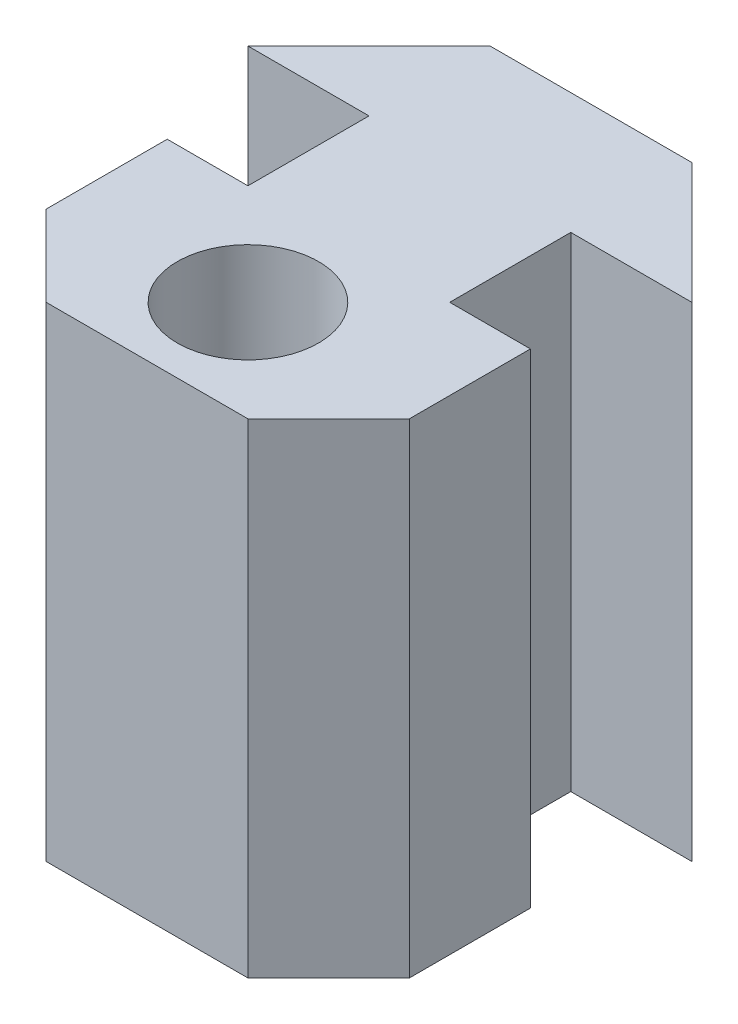
ISO-10303-21;
HEADER;
FILE_DESCRIPTION(('STEP AP214'),'2;1');
FILE_NAME('part.step','',(''),(''),'','','');
FILE_SCHEMA(('AUTOMOTIVE_DESIGN { 1 0 10303 214 1 1 1 1 }'));
ENDSEC;
DATA;
#1=APPLICATION_CONTEXT('core data for automotive mechanical design processes');
#2=APPLICATION_PROTOCOL_DEFINITION('international standard','automotive_design',2000,#1);
#3=PRODUCT_CONTEXT('',#1,'mechanical');
#4=PRODUCT('Part','Part','',(#3));
#5=PRODUCT_RELATED_PRODUCT_CATEGORY('part','',(#4));
#6=PRODUCT_DEFINITION_FORMATION('','',#4);
#7=PRODUCT_DEFINITION_CONTEXT('part definition',#1,'design');
#8=PRODUCT_DEFINITION('design','',#6,#7);
#9=PRODUCT_DEFINITION_SHAPE('','',#8);
#10=(LENGTH_UNIT() NAMED_UNIT(*) SI_UNIT(.MILLI.,.METRE.));
#11=(NAMED_UNIT(*) PLANE_ANGLE_UNIT() SI_UNIT($,.RADIAN.));
#12=(NAMED_UNIT(*) SI_UNIT($,.STERADIAN.) SOLID_ANGLE_UNIT());
#13=UNCERTAINTY_MEASURE_WITH_UNIT(LENGTH_MEASURE(1.E-05),#10,'distance_accuracy_value','');
#14=(GEOMETRIC_REPRESENTATION_CONTEXT(3) GLOBAL_UNCERTAINTY_ASSIGNED_CONTEXT((#13)) GLOBAL_UNIT_ASSIGNED_CONTEXT((#10,
#11,#12)) REPRESENTATION_CONTEXT('',''));
#15=CARTESIAN_POINT('',(0.,0.,0.));
#16=DIRECTION('',(0.,0.,1.));
#17=DIRECTION('',(1.,0.,0.));
#18=AXIS2_PLACEMENT_3D('',#15,#16,#17);
#19=CARTESIAN_POINT('',(0.,12.,0.));
#20=DIRECTION('',(0.,-1.,0.));
#21=DIRECTION('',(0.,0.,-1.));
#22=AXIS2_PLACEMENT_3D('',#19,#20,#21);
#23=PLANE('',#22);
#24=DIRECTION('',(0.,0.,1.));
#25=VECTOR('',#24,1.);
#26=CARTESIAN_POINT('',(-4.5,12.,11.));
#27=LINE('',#26,#25);
#28=CARTESIAN_POINT('',(-4.5,12.,6.));
#29=VERTEX_POINT('',#28);
#30=CARTESIAN_POINT('',(-4.5,12.,9.));
#31=VERTEX_POINT('',#30);
#32=EDGE_CURVE('E187',#29,#31,#27,.T.);
#33=ORIENTED_EDGE('',*,*,#32,.T.);
#34=DIRECTION('',(-0.707106781186547,0.,-0.707106781186548));
#35=VECTOR('',#34,1.);
#36=CARTESIAN_POINT('',(-2.5,12.,11.));
#37=LINE('',#36,#35);
#38=CARTESIAN_POINT('',(-2.5,12.,11.));
#39=VERTEX_POINT('',#38);
#40=EDGE_CURVE('E50',#31,#39,#37,.F.);
#41=ORIENTED_EDGE('',*,*,#40,.T.);
#42=DIRECTION('',(1.,0.,0.));
#43=VECTOR('',#42,1.);
#44=CARTESIAN_POINT('',(4.5,12.,11.));
#45=LINE('',#44,#43);
#46=CARTESIAN_POINT('',(2.5,12.,11.));
#47=VERTEX_POINT('',#46);
#48=EDGE_CURVE('E186',#39,#47,#45,.T.);
#49=ORIENTED_EDGE('',*,*,#48,.T.);
#50=DIRECTION('',(-0.707106781186548,0.,0.707106781186547));
#51=VECTOR('',#50,1.);
#52=CARTESIAN_POINT('',(4.5,12.,9.));
#53=LINE('',#52,#51);
#54=CARTESIAN_POINT('',(4.5,12.,9.));
#55=VERTEX_POINT('',#54);
#56=EDGE_CURVE('E57',#47,#55,#53,.F.);
#57=ORIENTED_EDGE('',*,*,#56,.T.);
#58=DIRECTION('',(0.,0.,-1.));
#59=VECTOR('',#58,1.);
#60=CARTESIAN_POINT('',(4.5,12.,11.));
#61=LINE('',#60,#59);
#62=CARTESIAN_POINT('',(4.5,12.,6.));
#63=VERTEX_POINT('',#62);
#64=EDGE_CURVE('E160',#55,#63,#61,.T.);
#65=ORIENTED_EDGE('',*,*,#64,.T.);
#66=DIRECTION('',(-1.,0.,0.));
#67=VECTOR('',#66,1.);
#68=CARTESIAN_POINT('',(4.5,12.,6.));
#69=LINE('',#68,#67);
#70=CARTESIAN_POINT('',(2.5,12.,6.));
#71=VERTEX_POINT('',#70);
#72=EDGE_CURVE('E156',#63,#71,#69,.T.);
#73=ORIENTED_EDGE('',*,*,#72,.T.);
#74=DIRECTION('',(0.,0.,-1.));
#75=VECTOR('',#74,1.);
#76=CARTESIAN_POINT('',(2.5,12.,6.));
#77=LINE('',#76,#75);
#78=CARTESIAN_POINT('',(2.5,12.,3.));
#79=VERTEX_POINT('',#78);
#80=EDGE_CURVE('E146',#71,#79,#77,.T.);
#81=ORIENTED_EDGE('',*,*,#80,.T.);
#82=DIRECTION('',(1.,0.,0.));
#83=VECTOR('',#82,1.);
#84=CARTESIAN_POINT('',(2.5,12.,3.));
#85=LINE('',#84,#83);
#86=CARTESIAN_POINT('',(5.5,12.,3.));
#87=VERTEX_POINT('',#86);
#88=EDGE_CURVE('E155',#79,#87,#85,.T.);
#89=ORIENTED_EDGE('',*,*,#88,.T.);
#90=DIRECTION('',(-0.707106781186548,0.,-0.707106781186547));
#91=VECTOR('',#90,1.);
#92=CARTESIAN_POINT('',(5.5,12.,3.));
#93=LINE('',#92,#91);
#94=CARTESIAN_POINT('',(2.5,12.,0.));
#95=VERTEX_POINT('',#94);
#96=EDGE_CURVE('E241',#87,#95,#93,.T.);
#97=ORIENTED_EDGE('',*,*,#96,.T.);
#98=DIRECTION('',(-1.,0.,0.));
#99=VECTOR('',#98,1.);
#100=CARTESIAN_POINT('',(2.5,12.,0.));
#101=LINE('',#100,#99);
#102=CARTESIAN_POINT('',(-2.5,12.,0.));
#103=VERTEX_POINT('',#102);
#104=EDGE_CURVE('E279',#95,#103,#101,.T.);
#105=ORIENTED_EDGE('',*,*,#104,.T.);
#106=DIRECTION('',(-0.707106781186548,0.,0.707106781186547));
#107=VECTOR('',#106,1.);
#108=CARTESIAN_POINT('',(-5.5,12.,3.));
#109=LINE('',#108,#107);
#110=CARTESIAN_POINT('',(-5.5,12.,3.));
#111=VERTEX_POINT('',#110);
#112=EDGE_CURVE('E283',#103,#111,#109,.T.);
#113=ORIENTED_EDGE('',*,*,#112,.T.);
#114=DIRECTION('',(1.,0.,0.));
#115=VECTOR('',#114,1.);
#116=CARTESIAN_POINT('',(-2.5,12.,3.));
#117=LINE('',#116,#115);
#118=CARTESIAN_POINT('',(-2.5,12.,3.));
#119=VERTEX_POINT('',#118);
#120=EDGE_CURVE('E271',#111,#119,#117,.T.);
#121=ORIENTED_EDGE('',*,*,#120,.T.);
#122=DIRECTION('',(0.,0.,1.));
#123=VECTOR('',#122,1.);
#124=CARTESIAN_POINT('',(-2.5,12.,6.));
#125=LINE('',#124,#123);
#126=CARTESIAN_POINT('',(-2.5,12.,6.));
#127=VERTEX_POINT('',#126);
#128=EDGE_CURVE('E268',#119,#127,#125,.T.);
#129=ORIENTED_EDGE('',*,*,#128,.T.);
#130=DIRECTION('',(-1.,0.,0.));
#131=VECTOR('',#130,1.);
#132=CARTESIAN_POINT('',(-2.5,12.,6.));
#133=LINE('',#132,#131);
#134=EDGE_CURVE('E267',#127,#29,#133,.T.);
#135=ORIENTED_EDGE('',*,*,#134,.T.);
#136=EDGE_LOOP('',(#33,#41,#49,#57,#65,#73,#81,#89,#97,#105,#113,#121,#129,#135));
#137=FACE_BOUND('',#136,.T.);
#138=CARTESIAN_POINT('',(0.,12.,8.5));
#139=DIRECTION('',(0.,1.,0.));
#140=DIRECTION('',(0.,0.,1.));
#141=AXIS2_PLACEMENT_3D('',#138,#139,#140);
#142=CIRCLE('',#141,1.75);
#143=CARTESIAN_POINT('',(0.,12.,10.25));
#144=VERTEX_POINT('',#143);
#145=EDGE_CURVE('E276',#144,#144,#142,.T.);
#146=ORIENTED_EDGE('',*,*,#145,.F.);
#147=EDGE_LOOP('',(#146));
#148=FACE_BOUND('',#147,.T.);
#149=ADVANCED_FACE('F41',(#137,#148),#23,.F.);
#150=CARTESIAN_POINT('',(0.,0.,0.));
#151=DIRECTION('',(0.,-1.,0.));
#152=DIRECTION('',(0.,0.,-1.));
#153=AXIS2_PLACEMENT_3D('',#150,#151,#152);
#154=PLANE('',#153);
#155=DIRECTION('',(1.,0.,0.));
#156=VECTOR('',#155,1.);
#157=CARTESIAN_POINT('',(4.5,0.,11.));
#158=LINE('',#157,#156);
#159=CARTESIAN_POINT('',(-2.5,0.,11.));
#160=VERTEX_POINT('',#159);
#161=CARTESIAN_POINT('',(2.5,0.,11.));
#162=VERTEX_POINT('',#161);
#163=EDGE_CURVE('E203',#160,#162,#158,.T.);
#164=ORIENTED_EDGE('',*,*,#163,.F.);
#165=DIRECTION('',(0.707106781186547,0.,0.707106781186548));
#166=VECTOR('',#165,1.);
#167=CARTESIAN_POINT('',(-6.75000000000001,0.,6.74999999999999));
#168=LINE('',#167,#166);
#169=CARTESIAN_POINT('',(-4.5,0.,9.));
#170=VERTEX_POINT('',#169);
#171=EDGE_CURVE('E181',#160,#170,#168,.F.);
#172=ORIENTED_EDGE('',*,*,#171,.T.);
#173=DIRECTION('',(0.,0.,1.));
#174=VECTOR('',#173,1.);
#175=CARTESIAN_POINT('',(-4.5,0.,11.));
#176=LINE('',#175,#174);
#177=CARTESIAN_POINT('',(-4.5,0.,6.));
#178=VERTEX_POINT('',#177);
#179=EDGE_CURVE('E202',#178,#170,#176,.T.);
#180=ORIENTED_EDGE('',*,*,#179,.F.);
#181=DIRECTION('',(-1.,0.,0.));
#182=VECTOR('',#181,1.);
#183=CARTESIAN_POINT('',(-2.5,0.,6.));
#184=LINE('',#183,#182);
#185=CARTESIAN_POINT('',(-2.5,0.,6.));
#186=VERTEX_POINT('',#185);
#187=EDGE_CURVE('E208',#186,#178,#184,.T.);
#188=ORIENTED_EDGE('',*,*,#187,.F.);
#189=DIRECTION('',(0.,0.,1.));
#190=VECTOR('',#189,1.);
#191=CARTESIAN_POINT('',(-2.5,0.,6.));
#192=LINE('',#191,#190);
#193=CARTESIAN_POINT('',(-2.5,0.,3.));
#194=VERTEX_POINT('',#193);
#195=EDGE_CURVE('E211',#194,#186,#192,.T.);
#196=ORIENTED_EDGE('',*,*,#195,.F.);
#197=DIRECTION('',(1.,0.,0.));
#198=VECTOR('',#197,1.);
#199=CARTESIAN_POINT('',(-2.5,0.,3.));
#200=LINE('',#199,#198);
#201=CARTESIAN_POINT('',(-5.5,0.,3.));
#202=VERTEX_POINT('',#201);
#203=EDGE_CURVE('E256',#202,#194,#200,.T.);
#204=ORIENTED_EDGE('',*,*,#203,.F.);
#205=DIRECTION('',(-0.707106781186548,0.,0.707106781186547));
#206=VECTOR('',#205,1.);
#207=CARTESIAN_POINT('',(-5.5,0.,3.));
#208=LINE('',#207,#206);
#209=CARTESIAN_POINT('',(-2.5,0.,0.));
#210=VERTEX_POINT('',#209);
#211=EDGE_CURVE('E249',#210,#202,#208,.T.);
#212=ORIENTED_EDGE('',*,*,#211,.F.);
#213=DIRECTION('',(-1.,0.,0.));
#214=VECTOR('',#213,1.);
#215=CARTESIAN_POINT('',(2.5,0.,0.));
#216=LINE('',#215,#214);
#217=CARTESIAN_POINT('',(2.5,0.,0.));
#218=VERTEX_POINT('',#217);
#219=EDGE_CURVE('E247',#218,#210,#216,.T.);
#220=ORIENTED_EDGE('',*,*,#219,.F.);
#221=DIRECTION('',(-0.707106781186548,0.,-0.707106781186547));
#222=VECTOR('',#221,1.);
#223=CARTESIAN_POINT('',(5.5,0.,3.));
#224=LINE('',#223,#222);
#225=CARTESIAN_POINT('',(5.5,0.,3.));
#226=VERTEX_POINT('',#225);
#227=EDGE_CURVE('E240',#226,#218,#224,.T.);
#228=ORIENTED_EDGE('',*,*,#227,.F.);
#229=DIRECTION('',(1.,0.,0.));
#230=VECTOR('',#229,1.);
#231=CARTESIAN_POINT('',(2.5,0.,3.));
#232=LINE('',#231,#230);
#233=CARTESIAN_POINT('',(2.5,0.,3.));
#234=VERTEX_POINT('',#233);
#235=EDGE_CURVE('E245',#234,#226,#232,.T.);
#236=ORIENTED_EDGE('',*,*,#235,.F.);
#237=DIRECTION('',(0.,0.,-1.));
#238=VECTOR('',#237,1.);
#239=CARTESIAN_POINT('',(2.5,0.,6.));
#240=LINE('',#239,#238);
#241=CARTESIAN_POINT('',(2.5,0.,6.));
#242=VERTEX_POINT('',#241);
#243=EDGE_CURVE('E251',#242,#234,#240,.T.);
#244=ORIENTED_EDGE('',*,*,#243,.F.);
#245=DIRECTION('',(-1.,0.,0.));
#246=VECTOR('',#245,1.);
#247=CARTESIAN_POINT('',(4.5,0.,6.));
#248=LINE('',#247,#246);
#249=CARTESIAN_POINT('',(4.5,0.,6.));
#250=VERTEX_POINT('',#249);
#251=EDGE_CURVE('E168',#250,#242,#248,.T.);
#252=ORIENTED_EDGE('',*,*,#251,.F.);
#253=DIRECTION('',(0.,0.,-1.));
#254=VECTOR('',#253,1.);
#255=CARTESIAN_POINT('',(4.5,0.,11.));
#256=LINE('',#255,#254);
#257=CARTESIAN_POINT('',(4.5,0.,9.));
#258=VERTEX_POINT('',#257);
#259=EDGE_CURVE('E164',#258,#250,#256,.T.);
#260=ORIENTED_EDGE('',*,*,#259,.F.);
#261=DIRECTION('',(0.707106781186548,0.,-0.707106781186547));
#262=VECTOR('',#261,1.);
#263=CARTESIAN_POINT('',(6.74999999999999,0.,6.75000000000001));
#264=LINE('',#263,#262);
#265=EDGE_CURVE('E179',#258,#162,#264,.F.);
#266=ORIENTED_EDGE('',*,*,#265,.T.);
#267=EDGE_LOOP('',(#164,#172,#180,#188,#196,#204,#212,#220,#228,#236,#244,#252,#260,#266));
#268=FACE_BOUND('',#267,.T.);
#269=CARTESIAN_POINT('',(0.,0.,8.5));
#270=DIRECTION('',(0.,1.,0.));
#271=DIRECTION('',(0.,0.,1.));
#272=AXIS2_PLACEMENT_3D('',#269,#270,#271);
#273=CIRCLE('',#272,1.75);
#274=CARTESIAN_POINT('',(0.,0.,10.25));
#275=VERTEX_POINT('',#274);
#276=EDGE_CURVE('E446',#275,#275,#273,.T.);
#277=ORIENTED_EDGE('',*,*,#276,.T.);
#278=EDGE_LOOP('',(#277));
#279=FACE_BOUND('',#278,.T.);
#280=ADVANCED_FACE('F199',(#268,#279),#154,.T.);
#281=CARTESIAN_POINT('',(4.5,12.,6.));
#282=DIRECTION('',(0.,0.,1.));
#283=DIRECTION('',(1.,0.,0.));
#284=AXIS2_PLACEMENT_3D('',#281,#282,#283);
#285=PLANE('',#284);
#286=ORIENTED_EDGE('',*,*,#251,.T.);
#287=DIRECTION('',(0.,-1.,0.));
#288=VECTOR('',#287,1.);
#289=CARTESIAN_POINT('',(2.5,12.,6.));
#290=LINE('',#289,#288);
#291=EDGE_CURVE('E150',#71,#242,#290,.T.);
#292=ORIENTED_EDGE('',*,*,#291,.F.);
#293=ORIENTED_EDGE('',*,*,#72,.F.);
#294=DIRECTION('',(0.,-1.,0.));
#295=VECTOR('',#294,1.);
#296=CARTESIAN_POINT('',(4.5,12.,6.));
#297=LINE('',#296,#295);
#298=EDGE_CURVE('E216',#63,#250,#297,.T.);
#299=ORIENTED_EDGE('',*,*,#298,.T.);
#300=EDGE_LOOP('',(#286,#292,#293,#299));
#301=FACE_BOUND('',#300,.T.);
#302=ADVANCED_FACE('F166',(#301),#285,.F.);
#303=CARTESIAN_POINT('',(2.5,12.,6.));
#304=DIRECTION('',(-1.,0.,0.));
#305=DIRECTION('',(0.,0.,1.));
#306=AXIS2_PLACEMENT_3D('',#303,#304,#305);
#307=PLANE('',#306);
#308=ORIENTED_EDGE('',*,*,#243,.T.);
#309=DIRECTION('',(0.,-1.,0.));
#310=VECTOR('',#309,1.);
#311=CARTESIAN_POINT('',(2.5,12.,3.));
#312=LINE('',#311,#310);
#313=EDGE_CURVE('E153',#79,#234,#312,.T.);
#314=ORIENTED_EDGE('',*,*,#313,.F.);
#315=ORIENTED_EDGE('',*,*,#80,.F.);
#316=ORIENTED_EDGE('',*,*,#291,.T.);
#317=EDGE_LOOP('',(#308,#314,#315,#316));
#318=FACE_BOUND('',#317,.T.);
#319=ADVANCED_FACE('F148',(#318),#307,.F.);
#320=CARTESIAN_POINT('',(2.5,12.,3.));
#321=DIRECTION('',(0.,0.,-1.));
#322=DIRECTION('',(-1.,0.,0.));
#323=AXIS2_PLACEMENT_3D('',#320,#321,#322);
#324=PLANE('',#323);
#325=ORIENTED_EDGE('',*,*,#235,.T.);
#326=DIRECTION('',(0.,-1.,0.));
#327=VECTOR('',#326,1.);
#328=CARTESIAN_POINT('',(5.5,12.,3.));
#329=LINE('',#328,#327);
#330=EDGE_CURVE('E173',#87,#226,#329,.T.);
#331=ORIENTED_EDGE('',*,*,#330,.F.);
#332=ORIENTED_EDGE('',*,*,#88,.F.);
#333=ORIENTED_EDGE('',*,*,#313,.T.);
#334=EDGE_LOOP('',(#325,#331,#332,#333));
#335=FACE_BOUND('',#334,.T.);
#336=ADVANCED_FACE('F277',(#335),#324,.F.);
#337=CARTESIAN_POINT('',(5.5,12.,3.));
#338=DIRECTION('',(-0.707106781186547,0.,0.707106781186548));
#339=DIRECTION('',(0.707106781186548,0.,0.707106781186547));
#340=AXIS2_PLACEMENT_3D('',#337,#338,#339);
#341=PLANE('',#340);
#342=ORIENTED_EDGE('',*,*,#227,.T.);
#343=DIRECTION('',(0.,-1.,0.));
#344=VECTOR('',#343,1.);
#345=CARTESIAN_POINT('',(2.5,12.,0.));
#346=LINE('',#345,#344);
#347=EDGE_CURVE('E231',#95,#218,#346,.T.);
#348=ORIENTED_EDGE('',*,*,#347,.F.);
#349=ORIENTED_EDGE('',*,*,#96,.F.);
#350=ORIENTED_EDGE('',*,*,#330,.T.);
#351=EDGE_LOOP('',(#342,#348,#349,#350));
#352=FACE_BOUND('',#351,.T.);
#353=ADVANCED_FACE('F238',(#352),#341,.F.);
#354=CARTESIAN_POINT('',(2.5,12.,0.));
#355=DIRECTION('',(0.,0.,1.));
#356=DIRECTION('',(1.,0.,0.));
#357=AXIS2_PLACEMENT_3D('',#354,#355,#356);
#358=PLANE('',#357);
#359=ORIENTED_EDGE('',*,*,#219,.T.);
#360=DIRECTION('',(0.,-1.,0.));
#361=VECTOR('',#360,1.);
#362=CARTESIAN_POINT('',(-2.5,12.,0.));
#363=LINE('',#362,#361);
#364=EDGE_CURVE('E228',#103,#210,#363,.T.);
#365=ORIENTED_EDGE('',*,*,#364,.F.);
#366=ORIENTED_EDGE('',*,*,#104,.F.);
#367=ORIENTED_EDGE('',*,*,#347,.T.);
#368=EDGE_LOOP('',(#359,#365,#366,#367));
#369=FACE_BOUND('',#368,.T.);
#370=ADVANCED_FACE('F294',(#369),#358,.F.);
#371=CARTESIAN_POINT('',(-5.5,12.,3.));
#372=DIRECTION('',(0.707106781186547,0.,0.707106781186548));
#373=DIRECTION('',(0.707106781186548,0.,-0.707106781186547));
#374=AXIS2_PLACEMENT_3D('',#371,#372,#373);
#375=PLANE('',#374);
#376=ORIENTED_EDGE('',*,*,#211,.T.);
#377=DIRECTION('',(0.,-1.,0.));
#378=VECTOR('',#377,1.);
#379=CARTESIAN_POINT('',(-5.5,12.,3.));
#380=LINE('',#379,#378);
#381=EDGE_CURVE('E225',#111,#202,#380,.T.);
#382=ORIENTED_EDGE('',*,*,#381,.F.);
#383=ORIENTED_EDGE('',*,*,#112,.F.);
#384=ORIENTED_EDGE('',*,*,#364,.T.);
#385=EDGE_LOOP('',(#376,#382,#383,#384));
#386=FACE_BOUND('',#385,.T.);
#387=ADVANCED_FACE('F290',(#386),#375,.F.);
#388=CARTESIAN_POINT('',(-2.5,12.,3.));
#389=DIRECTION('',(0.,0.,-1.));
#390=DIRECTION('',(-1.,0.,0.));
#391=AXIS2_PLACEMENT_3D('',#388,#389,#390);
#392=PLANE('',#391);
#393=ORIENTED_EDGE('',*,*,#203,.T.);
#394=DIRECTION('',(0.,-1.,0.));
#395=VECTOR('',#394,1.);
#396=CARTESIAN_POINT('',(-2.5,12.,3.));
#397=LINE('',#396,#395);
#398=EDGE_CURVE('E222',#119,#194,#397,.T.);
#399=ORIENTED_EDGE('',*,*,#398,.F.);
#400=ORIENTED_EDGE('',*,*,#120,.F.);
#401=ORIENTED_EDGE('',*,*,#381,.T.);
#402=EDGE_LOOP('',(#393,#399,#400,#401));
#403=FACE_BOUND('',#402,.T.);
#404=ADVANCED_FACE('F288',(#403),#392,.F.);
#405=CARTESIAN_POINT('',(-2.5,12.,6.));
#406=DIRECTION('',(1.,0.,0.));
#407=DIRECTION('',(0.,0.,-1.));
#408=AXIS2_PLACEMENT_3D('',#405,#406,#407);
#409=PLANE('',#408);
#410=ORIENTED_EDGE('',*,*,#195,.T.);
#411=DIRECTION('',(0.,-1.,0.));
#412=VECTOR('',#411,1.);
#413=CARTESIAN_POINT('',(-2.5,12.,6.));
#414=LINE('',#413,#412);
#415=EDGE_CURVE('E219',#127,#186,#414,.T.);
#416=ORIENTED_EDGE('',*,*,#415,.F.);
#417=ORIENTED_EDGE('',*,*,#128,.F.);
#418=ORIENTED_EDGE('',*,*,#398,.T.);
#419=EDGE_LOOP('',(#410,#416,#417,#418));
#420=FACE_BOUND('',#419,.T.);
#421=ADVANCED_FACE('F260',(#420),#409,.F.);
#422=CARTESIAN_POINT('',(-2.5,12.,6.));
#423=DIRECTION('',(0.,0.,1.));
#424=DIRECTION('',(1.,0.,0.));
#425=AXIS2_PLACEMENT_3D('',#422,#423,#424);
#426=PLANE('',#425);
#427=ORIENTED_EDGE('',*,*,#187,.T.);
#428=DIRECTION('',(0.,-1.,0.));
#429=VECTOR('',#428,1.);
#430=CARTESIAN_POINT('',(-4.5,12.,6.));
#431=LINE('',#430,#429);
#432=EDGE_CURVE('E207',#29,#178,#431,.T.);
#433=ORIENTED_EDGE('',*,*,#432,.F.);
#434=ORIENTED_EDGE('',*,*,#134,.F.);
#435=ORIENTED_EDGE('',*,*,#415,.T.);
#436=EDGE_LOOP('',(#427,#433,#434,#435));
#437=FACE_BOUND('',#436,.T.);
#438=ADVANCED_FACE('F266',(#437),#426,.F.);
#439=CARTESIAN_POINT('',(-4.5,12.,11.));
#440=DIRECTION('',(1.,0.,0.));
#441=DIRECTION('',(0.,0.,-1.));
#442=AXIS2_PLACEMENT_3D('',#439,#440,#441);
#443=PLANE('',#442);
#444=ORIENTED_EDGE('',*,*,#179,.T.);
#445=DIRECTION('',(0.,1.,0.));
#446=VECTOR('',#445,1.);
#447=CARTESIAN_POINT('',(-4.5,12.,9.));
#448=LINE('',#447,#446);
#449=EDGE_CURVE('E65',#170,#31,#448,.T.);
#450=ORIENTED_EDGE('',*,*,#449,.T.);
#451=ORIENTED_EDGE('',*,*,#32,.F.);
#452=ORIENTED_EDGE('',*,*,#432,.T.);
#453=EDGE_LOOP('',(#444,#450,#451,#452));
#454=FACE_BOUND('',#453,.T.);
#455=ADVANCED_FACE('F205',(#454),#443,.F.);
#456=CARTESIAN_POINT('',(4.5,12.,11.));
#457=DIRECTION('',(0.,0.,-1.));
#458=DIRECTION('',(-1.,0.,0.));
#459=AXIS2_PLACEMENT_3D('',#456,#457,#458);
#460=PLANE('',#459);
#461=ORIENTED_EDGE('',*,*,#48,.F.);
#462=DIRECTION('',(0.,-1.,0.));
#463=VECTOR('',#462,1.);
#464=CARTESIAN_POINT('',(-2.5,12.,11.));
#465=LINE('',#464,#463);
#466=EDGE_CURVE('E171',#39,#160,#465,.T.);
#467=ORIENTED_EDGE('',*,*,#466,.T.);
#468=ORIENTED_EDGE('',*,*,#163,.T.);
#469=DIRECTION('',(0.,1.,0.));
#470=VECTOR('',#469,1.);
#471=CARTESIAN_POINT('',(2.5,12.,11.));
#472=LINE('',#471,#470);
#473=EDGE_CURVE('E169',#162,#47,#472,.T.);
#474=ORIENTED_EDGE('',*,*,#473,.T.);
#475=EDGE_LOOP('',(#461,#467,#468,#474));
#476=FACE_BOUND('',#475,.T.);
#477=ADVANCED_FACE('F191',(#476),#460,.F.);
#478=CARTESIAN_POINT('',(4.5,12.,11.));
#479=DIRECTION('',(-1.,0.,0.));
#480=DIRECTION('',(0.,0.,1.));
#481=AXIS2_PLACEMENT_3D('',#478,#479,#480);
#482=PLANE('',#481);
#483=ORIENTED_EDGE('',*,*,#64,.F.);
#484=DIRECTION('',(0.,-1.,0.));
#485=VECTOR('',#484,1.);
#486=CARTESIAN_POINT('',(4.5,12.,9.));
#487=LINE('',#486,#485);
#488=EDGE_CURVE('E11',#55,#258,#487,.T.);
#489=ORIENTED_EDGE('',*,*,#488,.T.);
#490=ORIENTED_EDGE('',*,*,#259,.T.);
#491=ORIENTED_EDGE('',*,*,#298,.F.);
#492=EDGE_LOOP('',(#483,#489,#490,#491));
#493=FACE_BOUND('',#492,.T.);
#494=ADVANCED_FACE('F313',(#493),#482,.F.);
#495=CARTESIAN_POINT('',(0.,12.,8.5));
#496=DIRECTION('',(0.,-1.,0.));
#497=DIRECTION('',(0.,0.,-1.));
#498=AXIS2_PLACEMENT_3D('',#495,#496,#497);
#499=CYLINDRICAL_SURFACE('',#498,1.75);
#500=ORIENTED_EDGE('',*,*,#145,.T.);
#501=EDGE_LOOP('',(#500));
#502=FACE_BOUND('',#501,.T.);
#503=ORIENTED_EDGE('',*,*,#276,.F.);
#504=EDGE_LOOP('',(#503));
#505=FACE_BOUND('',#504,.T.);
#506=ADVANCED_FACE('F311',(#502,#505),#499,.F.);
#507=CARTESIAN_POINT('',(-2.5,12.,11.));
#508=DIRECTION('',(0.707106781186548,0.,-0.707106781186547));
#509=DIRECTION('',(0.,-1.,0.));
#510=AXIS2_PLACEMENT_3D('',#507,#508,#509);
#511=PLANE('',#510);
#512=ORIENTED_EDGE('',*,*,#40,.F.);
#513=ORIENTED_EDGE('',*,*,#449,.F.);
#514=ORIENTED_EDGE('',*,*,#171,.F.);
#515=ORIENTED_EDGE('',*,*,#466,.F.);
#516=EDGE_LOOP('',(#512,#513,#514,#515));
#517=FACE_BOUND('',#516,.T.);
#518=ADVANCED_FACE('F196',(#517),#511,.F.);
#519=CARTESIAN_POINT('',(4.5,12.,9.));
#520=DIRECTION('',(-0.707106781186547,0.,-0.707106781186548));
#521=DIRECTION('',(0.,-1.,0.));
#522=AXIS2_PLACEMENT_3D('',#519,#520,#521);
#523=PLANE('',#522);
#524=ORIENTED_EDGE('',*,*,#56,.F.);
#525=ORIENTED_EDGE('',*,*,#473,.F.);
#526=ORIENTED_EDGE('',*,*,#265,.F.);
#527=ORIENTED_EDGE('',*,*,#488,.F.);
#528=EDGE_LOOP('',(#524,#525,#526,#527));
#529=FACE_BOUND('',#528,.T.);
#530=ADVANCED_FACE('F44',(#529),#523,.F.);
#531=CLOSED_SHELL('',(#149,#280,#302,#319,#336,#353,#370,#387,#404,#421,#438,#455,#477,#494,
#506,#518,#530));
#532=MANIFOLD_SOLID_BREP('B2',#531);
#533=ADVANCED_BREP_SHAPE_REPRESENTATION('',(#18,#532),#14);
#534=SHAPE_DEFINITION_REPRESENTATION(#9,#533);
ENDSEC;
END-ISO-10303-21;
